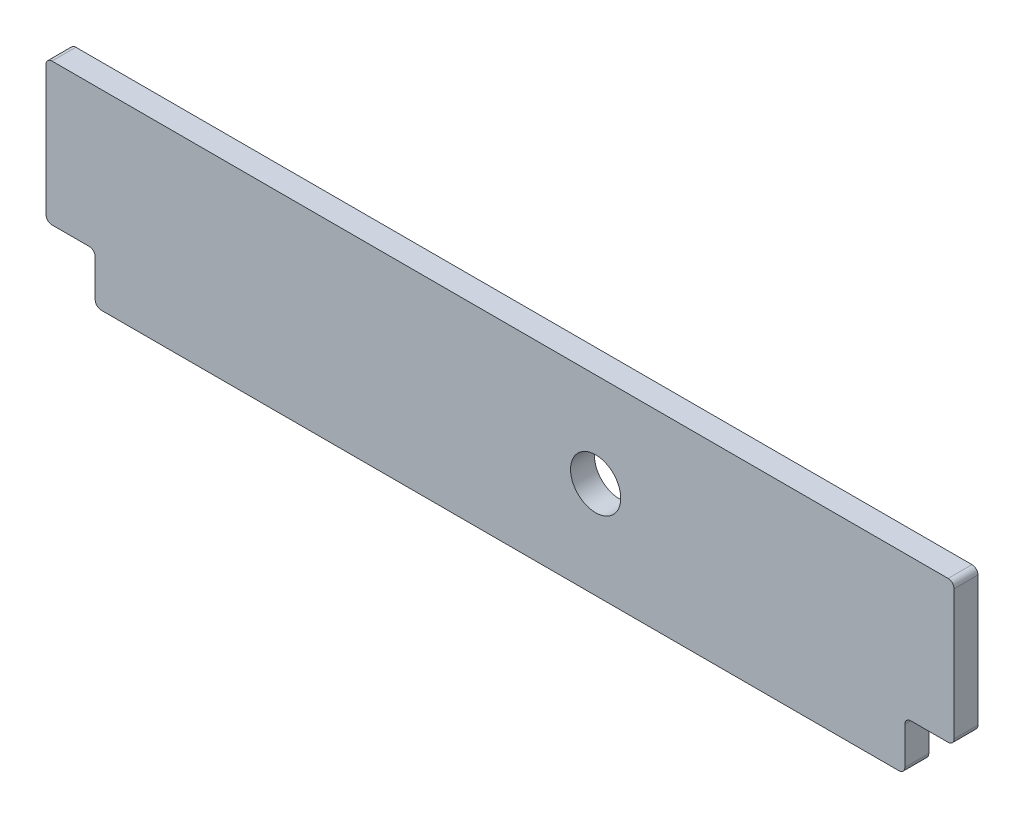
ISO-10303-21;
HEADER;
FILE_DESCRIPTION(('STEP AP214'),'2;1');
FILE_NAME('part.step','',(''),(''),'','','');
FILE_SCHEMA(('AUTOMOTIVE_DESIGN { 1 0 10303 214 1 1 1 1 }'));
ENDSEC;
DATA;
#1=APPLICATION_CONTEXT('core data for automotive mechanical design processes');
#2=APPLICATION_PROTOCOL_DEFINITION('international standard','automotive_design',2000,#1);
#3=PRODUCT_CONTEXT('',#1,'mechanical');
#4=PRODUCT('Part','Part','',(#3));
#5=PRODUCT_RELATED_PRODUCT_CATEGORY('part','',(#4));
#6=PRODUCT_DEFINITION_FORMATION('','',#4);
#7=PRODUCT_DEFINITION_CONTEXT('part definition',#1,'design');
#8=PRODUCT_DEFINITION('design','',#6,#7);
#9=PRODUCT_DEFINITION_SHAPE('','',#8);
#10=(LENGTH_UNIT() NAMED_UNIT(*) SI_UNIT(.MILLI.,.METRE.));
#11=(NAMED_UNIT(*) PLANE_ANGLE_UNIT() SI_UNIT($,.RADIAN.));
#12=(NAMED_UNIT(*) SI_UNIT($,.STERADIAN.) SOLID_ANGLE_UNIT());
#13=UNCERTAINTY_MEASURE_WITH_UNIT(LENGTH_MEASURE(1.E-05),#10,'distance_accuracy_value','');
#14=(GEOMETRIC_REPRESENTATION_CONTEXT(3) GLOBAL_UNCERTAINTY_ASSIGNED_CONTEXT((#13)) GLOBAL_UNIT_ASSIGNED_CONTEXT((#10,
#11,#12)) REPRESENTATION_CONTEXT('',''));
#15=CARTESIAN_POINT('',(0.,0.,0.));
#16=DIRECTION('',(0.,0.,1.));
#17=DIRECTION('',(1.,0.,0.));
#18=AXIS2_PLACEMENT_3D('',#15,#16,#17);
#19=CARTESIAN_POINT('',(215.138,0.,6.35));
#20=DIRECTION('',(-1.,0.,0.));
#21=DIRECTION('',(0.,-1.,0.));
#22=AXIS2_PLACEMENT_3D('',#19,#20,#21);
#23=PLANE('',#22);
#24=DIRECTION('',(0.,1.,0.));
#25=VECTOR('',#24,1.);
#26=CARTESIAN_POINT('',(215.138,2.35089725464378E-13,6.35));
#27=LINE('',#26,#25);
#28=CARTESIAN_POINT('',(215.138,3.17500000000005,6.35));
#29=VERTEX_POINT('',#28);
#30=CARTESIAN_POINT('',(215.138,22.9869999999999,6.35));
#31=VERTEX_POINT('',#30);
#32=EDGE_CURVE('E238',#29,#31,#27,.T.);
#33=ORIENTED_EDGE('',*,*,#32,.F.);
#34=DIRECTION('',(0.,0.,-1.));
#35=VECTOR('',#34,1.);
#36=CARTESIAN_POINT('',(215.138,3.17500000000005,6.35));
#37=LINE('',#36,#35);
#38=CARTESIAN_POINT('',(215.138,3.17500000000005,-6.35));
#39=VERTEX_POINT('',#38);
#40=EDGE_CURVE('E295',#29,#39,#37,.T.);
#41=ORIENTED_EDGE('',*,*,#40,.T.);
#42=DIRECTION('',(0.,1.,0.));
#43=VECTOR('',#42,1.);
#44=CARTESIAN_POINT('',(215.138,2.35089725464378E-13,-6.35));
#45=LINE('',#44,#43);
#46=CARTESIAN_POINT('',(215.138,22.9869999999999,-6.35));
#47=VERTEX_POINT('',#46);
#48=EDGE_CURVE('E234',#39,#47,#45,.T.);
#49=ORIENTED_EDGE('',*,*,#48,.T.);
#50=DIRECTION('',(0.,0.,-1.));
#51=VECTOR('',#50,1.);
#52=CARTESIAN_POINT('',(215.138,22.9869999999999,6.35));
#53=LINE('',#52,#51);
#54=EDGE_CURVE('E292',#47,#31,#53,.F.);
#55=ORIENTED_EDGE('',*,*,#54,.T.);
#56=EDGE_LOOP('',(#33,#41,#49,#55));
#57=FACE_BOUND('',#56,.T.);
#58=ADVANCED_FACE('F46',(#57),#23,.F.);
#59=CARTESIAN_POINT('',(215.9,26.1619999999999,6.35));
#60=DIRECTION('',(0.,1.,0.));
#61=DIRECTION('',(-1.,0.,0.));
#62=AXIS2_PLACEMENT_3D('',#59,#60,#61);
#63=PLANE('',#62);
#64=DIRECTION('',(1.,0.,0.));
#65=VECTOR('',#64,1.);
#66=CARTESIAN_POINT('',(0.,26.162,6.35));
#67=LINE('',#66,#65);
#68=CARTESIAN_POINT('',(218.313,26.1619999999999,6.35));
#69=VERTEX_POINT('',#68);
#70=CARTESIAN_POINT('',(238.125,26.1619999999999,6.35));
#71=VERTEX_POINT('',#70);
#72=EDGE_CURVE('E220',#69,#71,#67,.T.);
#73=ORIENTED_EDGE('',*,*,#72,.F.);
#74=DIRECTION('',(0.,0.,-1.));
#75=VECTOR('',#74,1.);
#76=CARTESIAN_POINT('',(218.313,26.1619999999999,-6.35));
#77=LINE('',#76,#75);
#78=CARTESIAN_POINT('',(218.313,26.1619999999999,-6.35));
#79=VERTEX_POINT('',#78);
#80=EDGE_CURVE('E308',#69,#79,#77,.T.);
#81=ORIENTED_EDGE('',*,*,#80,.T.);
#82=DIRECTION('',(1.,0.,0.));
#83=VECTOR('',#82,1.);
#84=CARTESIAN_POINT('',(0.,26.162,-6.35));
#85=LINE('',#84,#83);
#86=CARTESIAN_POINT('',(238.125,26.1619999999999,-6.35));
#87=VERTEX_POINT('',#86);
#88=EDGE_CURVE('E200',#79,#87,#85,.T.);
#89=ORIENTED_EDGE('',*,*,#88,.T.);
#90=DIRECTION('',(0.,0.,-1.));
#91=VECTOR('',#90,1.);
#92=CARTESIAN_POINT('',(238.125,26.1619999999999,6.35));
#93=LINE('',#92,#91);
#94=EDGE_CURVE('E305',#87,#71,#93,.F.);
#95=ORIENTED_EDGE('',*,*,#94,.T.);
#96=EDGE_LOOP('',(#73,#81,#89,#95));
#97=FACE_BOUND('',#96,.T.);
#98=ADVANCED_FACE('F357',(#97),#63,.F.);
#99=CARTESIAN_POINT('',(241.3,101.6,6.35));
#100=DIRECTION('',(-1.,0.,0.));
#101=DIRECTION('',(0.,-1.,0.));
#102=AXIS2_PLACEMENT_3D('',#99,#100,#101);
#103=PLANE('',#102);
#104=DIRECTION('',(0.,1.,0.));
#105=VECTOR('',#104,1.);
#106=CARTESIAN_POINT('',(241.3,101.6,-6.35));
#107=LINE('',#106,#105);
#108=CARTESIAN_POINT('',(241.3,29.3369999999999,-6.35));
#109=VERTEX_POINT('',#108);
#110=CARTESIAN_POINT('',(241.3,98.4249999999999,-6.35));
#111=VERTEX_POINT('',#110);
#112=EDGE_CURVE('E193',#109,#111,#107,.T.);
#113=ORIENTED_EDGE('',*,*,#112,.T.);
#114=DIRECTION('',(0.,0.,-1.));
#115=VECTOR('',#114,1.);
#116=CARTESIAN_POINT('',(241.3,98.4249999999999,6.35));
#117=LINE('',#116,#115);
#118=CARTESIAN_POINT('',(241.3,98.4249999999999,6.35));
#119=VERTEX_POINT('',#118);
#120=EDGE_CURVE('E168',#111,#119,#117,.F.);
#121=ORIENTED_EDGE('',*,*,#120,.T.);
#122=DIRECTION('',(0.,1.,0.));
#123=VECTOR('',#122,1.);
#124=CARTESIAN_POINT('',(241.3,101.6,6.35));
#125=LINE('',#124,#123);
#126=CARTESIAN_POINT('',(241.3,29.3369999999999,6.35));
#127=VERTEX_POINT('',#126);
#128=EDGE_CURVE('E216',#127,#119,#125,.T.);
#129=ORIENTED_EDGE('',*,*,#128,.F.);
#130=DIRECTION('',(0.,0.,-1.));
#131=VECTOR('',#130,1.);
#132=CARTESIAN_POINT('',(241.3,29.3369999999999,6.35));
#133=LINE('',#132,#131);
#134=EDGE_CURVE('E174',#127,#109,#133,.T.);
#135=ORIENTED_EDGE('',*,*,#134,.T.);
#136=EDGE_LOOP('',(#113,#121,#129,#135));
#137=FACE_BOUND('',#136,.T.);
#138=ADVANCED_FACE('F350',(#137),#103,.F.);
#139=CARTESIAN_POINT('',(-241.3,101.6,6.35));
#140=DIRECTION('',(0.,-1.,0.));
#141=DIRECTION('',(1.,0.,0.));
#142=AXIS2_PLACEMENT_3D('',#139,#140,#141);
#143=PLANE('',#142);
#144=DIRECTION('',(-1.,0.,0.));
#145=VECTOR('',#144,1.);
#146=CARTESIAN_POINT('',(-241.3,101.6,6.35));
#147=LINE('',#146,#145);
#148=CARTESIAN_POINT('',(238.125,101.6,6.35));
#149=VERTEX_POINT('',#148);
#150=CARTESIAN_POINT('',(-238.125,101.6,6.35));
#151=VERTEX_POINT('',#150);
#152=EDGE_CURVE('E184',#149,#151,#147,.T.);
#153=ORIENTED_EDGE('',*,*,#152,.F.);
#154=DIRECTION('',(0.,0.,-1.));
#155=VECTOR('',#154,1.);
#156=CARTESIAN_POINT('',(238.125,101.6,6.35));
#157=LINE('',#156,#155);
#158=CARTESIAN_POINT('',(238.125,101.6,-6.35));
#159=VERTEX_POINT('',#158);
#160=EDGE_CURVE('E167',#149,#159,#157,.T.);
#161=ORIENTED_EDGE('',*,*,#160,.T.);
#162=DIRECTION('',(-1.,0.,0.));
#163=VECTOR('',#162,1.);
#164=CARTESIAN_POINT('',(-241.3,101.6,-6.35));
#165=LINE('',#164,#163);
#166=CARTESIAN_POINT('',(-238.125,101.6,-6.35));
#167=VERTEX_POINT('',#166);
#168=EDGE_CURVE('E181',#159,#167,#165,.T.);
#169=ORIENTED_EDGE('',*,*,#168,.T.);
#170=DIRECTION('',(0.,0.,-1.));
#171=VECTOR('',#170,1.);
#172=CARTESIAN_POINT('',(-238.125,101.6,6.35));
#173=LINE('',#172,#171);
#174=EDGE_CURVE('E187',#167,#151,#173,.F.);
#175=ORIENTED_EDGE('',*,*,#174,.T.);
#176=EDGE_LOOP('',(#153,#161,#169,#175));
#177=FACE_BOUND('',#176,.T.);
#178=ADVANCED_FACE('F180',(#177),#143,.F.);
#179=CARTESIAN_POINT('',(-241.3,101.6,6.35));
#180=DIRECTION('',(1.,0.,0.));
#181=DIRECTION('',(0.,0.,-1.));
#182=AXIS2_PLACEMENT_3D('',#179,#180,#181);
#183=PLANE('',#182);
#184=DIRECTION('',(0.,-1.,0.));
#185=VECTOR('',#184,1.);
#186=CARTESIAN_POINT('',(-241.3,101.6,6.35));
#187=LINE('',#186,#185);
#188=CARTESIAN_POINT('',(-241.3,98.4250000000001,6.35));
#189=VERTEX_POINT('',#188);
#190=CARTESIAN_POINT('',(-241.3,29.3370000000001,6.35));
#191=VERTEX_POINT('',#190);
#192=EDGE_CURVE('E209',#189,#191,#187,.T.);
#193=ORIENTED_EDGE('',*,*,#192,.F.);
#194=DIRECTION('',(0.,0.,-1.));
#195=VECTOR('',#194,1.);
#196=CARTESIAN_POINT('',(-241.3,98.4250000000001,6.35));
#197=LINE('',#196,#195);
#198=CARTESIAN_POINT('',(-241.3,98.4250000000001,-6.35));
#199=VERTEX_POINT('',#198);
#200=EDGE_CURVE('E288',#189,#199,#197,.T.);
#201=ORIENTED_EDGE('',*,*,#200,.T.);
#202=DIRECTION('',(0.,-1.,0.));
#203=VECTOR('',#202,1.);
#204=CARTESIAN_POINT('',(-241.3,101.6,-6.35));
#205=LINE('',#204,#203);
#206=CARTESIAN_POINT('',(-241.3,29.3370000000001,-6.35));
#207=VERTEX_POINT('',#206);
#208=EDGE_CURVE('E192',#199,#207,#205,.T.);
#209=ORIENTED_EDGE('',*,*,#208,.T.);
#210=DIRECTION('',(0.,0.,-1.));
#211=VECTOR('',#210,1.);
#212=CARTESIAN_POINT('',(-241.3,29.337,6.35));
#213=LINE('',#212,#211);
#214=EDGE_CURVE('E285',#207,#191,#213,.F.);
#215=ORIENTED_EDGE('',*,*,#214,.T.);
#216=EDGE_LOOP('',(#193,#201,#209,#215));
#217=FACE_BOUND('',#216,.T.);
#218=ADVANCED_FACE('F396',(#217),#183,.F.);
#219=CARTESIAN_POINT('',(-215.9,26.162,6.35));
#220=DIRECTION('',(0.,1.,0.));
#221=DIRECTION('',(0.,0.,1.));
#222=AXIS2_PLACEMENT_3D('',#219,#220,#221);
#223=PLANE('',#222);
#224=DIRECTION('',(1.,0.,0.));
#225=VECTOR('',#224,1.);
#226=CARTESIAN_POINT('',(0.,26.162,6.35));
#227=LINE('',#226,#225);
#228=CARTESIAN_POINT('',(-238.125,26.162,6.35));
#229=VERTEX_POINT('',#228);
#230=CARTESIAN_POINT('',(-218.313,26.162,6.35));
#231=VERTEX_POINT('',#230);
#232=EDGE_CURVE('E213',#229,#231,#227,.T.);
#233=ORIENTED_EDGE('',*,*,#232,.F.);
#234=DIRECTION('',(0.,0.,-1.));
#235=VECTOR('',#234,1.);
#236=CARTESIAN_POINT('',(-238.125,26.162,6.35));
#237=LINE('',#236,#235);
#238=CARTESIAN_POINT('',(-238.125,26.162,-6.35));
#239=VERTEX_POINT('',#238);
#240=EDGE_CURVE('E315',#229,#239,#237,.T.);
#241=ORIENTED_EDGE('',*,*,#240,.T.);
#242=DIRECTION('',(1.,0.,0.));
#243=VECTOR('',#242,1.);
#244=CARTESIAN_POINT('',(0.,26.162,-6.35));
#245=LINE('',#244,#243);
#246=CARTESIAN_POINT('',(-218.313,26.162,-6.35));
#247=VERTEX_POINT('',#246);
#248=EDGE_CURVE('E198',#239,#247,#245,.T.);
#249=ORIENTED_EDGE('',*,*,#248,.T.);
#250=DIRECTION('',(0.,0.,-1.));
#251=VECTOR('',#250,1.);
#252=CARTESIAN_POINT('',(-218.313,26.162,6.35));
#253=LINE('',#252,#251);
#254=EDGE_CURVE('E312',#247,#231,#253,.F.);
#255=ORIENTED_EDGE('',*,*,#254,.T.);
#256=EDGE_LOOP('',(#233,#241,#249,#255));
#257=FACE_BOUND('',#256,.T.);
#258=ADVANCED_FACE('F388',(#257),#223,.F.);
#259=CARTESIAN_POINT('',(-215.138,25.4,6.35));
#260=DIRECTION('',(1.,0.,0.));
#261=DIRECTION('',(0.,0.,-1.));
#262=AXIS2_PLACEMENT_3D('',#259,#260,#261);
#263=PLANE('',#262);
#264=DIRECTION('',(0.,-1.,0.));
#265=VECTOR('',#264,1.);
#266=CARTESIAN_POINT('',(-215.138,0.,-6.35));
#267=LINE('',#266,#265);
#268=CARTESIAN_POINT('',(-215.138,22.987,-6.35));
#269=VERTEX_POINT('',#268);
#270=CARTESIAN_POINT('',(-215.138,3.17500000000004,-6.35));
#271=VERTEX_POINT('',#270);
#272=EDGE_CURVE('E224',#269,#271,#267,.T.);
#273=ORIENTED_EDGE('',*,*,#272,.T.);
#274=DIRECTION('',(0.,0.,-1.));
#275=VECTOR('',#274,1.);
#276=CARTESIAN_POINT('',(-215.138,3.17500000000004,6.35));
#277=LINE('',#276,#275);
#278=CARTESIAN_POINT('',(-215.138,3.17500000000004,6.35));
#279=VERTEX_POINT('',#278);
#280=EDGE_CURVE('E323',#271,#279,#277,.F.);
#281=ORIENTED_EDGE('',*,*,#280,.T.);
#282=DIRECTION('',(0.,-1.,0.));
#283=VECTOR('',#282,1.);
#284=CARTESIAN_POINT('',(-215.138,0.,6.35));
#285=LINE('',#284,#283);
#286=CARTESIAN_POINT('',(-215.138,22.987,6.35));
#287=VERTEX_POINT('',#286);
#288=EDGE_CURVE('E208',#287,#279,#285,.T.);
#289=ORIENTED_EDGE('',*,*,#288,.F.);
#290=DIRECTION('',(0.,0.,-1.));
#291=VECTOR('',#290,1.);
#292=CARTESIAN_POINT('',(-215.138,22.987,-6.35));
#293=LINE('',#292,#291);
#294=EDGE_CURVE('E319',#287,#269,#293,.T.);
#295=ORIENTED_EDGE('',*,*,#294,.T.);
#296=EDGE_LOOP('',(#273,#281,#289,#295));
#297=FACE_BOUND('',#296,.T.);
#298=ADVANCED_FACE('F378',(#297),#263,.F.);
#299=CARTESIAN_POINT('',(-215.9,0.,6.35));
#300=DIRECTION('',(0.,1.,0.));
#301=DIRECTION('',(0.,0.,1.));
#302=AXIS2_PLACEMENT_3D('',#299,#300,#301);
#303=PLANE('',#302);
#304=DIRECTION('',(1.,0.,0.));
#305=VECTOR('',#304,1.);
#306=CARTESIAN_POINT('',(-215.9,0.,-6.35));
#307=LINE('',#306,#305);
#308=CARTESIAN_POINT('',(-211.963,0.,-6.35));
#309=VERTEX_POINT('',#308);
#310=CARTESIAN_POINT('',(211.963,0.,-6.35));
#311=VERTEX_POINT('',#310);
#312=EDGE_CURVE('E233',#309,#311,#307,.T.);
#313=ORIENTED_EDGE('',*,*,#312,.T.);
#314=DIRECTION('',(0.,0.,-1.));
#315=VECTOR('',#314,1.);
#316=CARTESIAN_POINT('',(211.963,0.,6.35));
#317=LINE('',#316,#315);
#318=CARTESIAN_POINT('',(211.963,0.,6.35));
#319=VERTEX_POINT('',#318);
#320=EDGE_CURVE('E64',#311,#319,#317,.F.);
#321=ORIENTED_EDGE('',*,*,#320,.T.);
#322=DIRECTION('',(1.,0.,0.));
#323=VECTOR('',#322,1.);
#324=CARTESIAN_POINT('',(-215.9,0.,6.35));
#325=LINE('',#324,#323);
#326=CARTESIAN_POINT('',(-211.963,0.,6.35));
#327=VERTEX_POINT('',#326);
#328=EDGE_CURVE('E204',#327,#319,#325,.T.);
#329=ORIENTED_EDGE('',*,*,#328,.F.);
#330=DIRECTION('',(0.,0.,-1.));
#331=VECTOR('',#330,1.);
#332=CARTESIAN_POINT('',(-211.963,0.,6.35));
#333=LINE('',#332,#331);
#334=EDGE_CURVE('E299',#327,#309,#333,.T.);
#335=ORIENTED_EDGE('',*,*,#334,.T.);
#336=EDGE_LOOP('',(#313,#321,#329,#335));
#337=FACE_BOUND('',#336,.T.);
#338=ADVANCED_FACE('F344',(#337),#303,.F.);
#339=CARTESIAN_POINT('',(0.,0.,6.35));
#340=DIRECTION('',(0.,0.,-1.));
#341=DIRECTION('',(-1.,0.,0.));
#342=AXIS2_PLACEMENT_3D('',#339,#340,#341);
#343=PLANE('',#342);
#344=CARTESIAN_POINT('',(50.8000000000006,51.5000000000016,6.34999999999999));
#345=DIRECTION('',(0.,0.,-1.));
#346=DIRECTION('',(-1.,0.,0.));
#347=AXIS2_PLACEMENT_3D('',#344,#345,#346);
#348=CIRCLE('',#347,13.3350000000001);
#349=CARTESIAN_POINT('',(37.4650000000005,51.5000000000016,6.34999999999999));
#350=VERTEX_POINT('',#349);
#351=EDGE_CURVE('E50',#350,#350,#348,.F.);
#352=ORIENTED_EDGE('',*,*,#351,.F.);
#353=EDGE_LOOP('',(#352));
#354=FACE_BOUND('',#353,.T.);
#355=ORIENTED_EDGE('',*,*,#128,.T.);
#356=CARTESIAN_POINT('',(238.125,98.4249999999999,6.35));
#357=DIRECTION('',(0.,0.,-1.));
#358=DIRECTION('',(-1.,0.,0.));
#359=AXIS2_PLACEMENT_3D('',#356,#357,#358);
#360=CIRCLE('',#359,3.175);
#361=EDGE_CURVE('E282',#119,#149,#360,.F.);
#362=ORIENTED_EDGE('',*,*,#361,.T.);
#363=ORIENTED_EDGE('',*,*,#152,.T.);
#364=CARTESIAN_POINT('',(-238.125,98.4250000000001,6.35));
#365=DIRECTION('',(0.,0.,-1.));
#366=DIRECTION('',(-1.,0.,0.));
#367=AXIS2_PLACEMENT_3D('',#364,#365,#366);
#368=CIRCLE('',#367,3.175);
#369=EDGE_CURVE('E279',#151,#189,#368,.F.);
#370=ORIENTED_EDGE('',*,*,#369,.T.);
#371=ORIENTED_EDGE('',*,*,#192,.T.);
#372=CARTESIAN_POINT('',(-238.125,29.337,6.35));
#373=DIRECTION('',(0.,0.,-1.));
#374=DIRECTION('',(-1.,0.,0.));
#375=AXIS2_PLACEMENT_3D('',#372,#373,#374);
#376=CIRCLE('',#375,3.175);
#377=EDGE_CURVE('E270',#191,#229,#376,.F.);
#378=ORIENTED_EDGE('',*,*,#377,.T.);
#379=ORIENTED_EDGE('',*,*,#232,.T.);
#380=CARTESIAN_POINT('',(-218.313,22.987,6.35));
#381=DIRECTION('',(0.,0.,-1.));
#382=DIRECTION('',(-1.,0.,0.));
#383=AXIS2_PLACEMENT_3D('',#380,#381,#382);
#384=CIRCLE('',#383,3.175);
#385=EDGE_CURVE('E12',#231,#287,#384,.T.);
#386=ORIENTED_EDGE('',*,*,#385,.T.);
#387=ORIENTED_EDGE('',*,*,#288,.T.);
#388=CARTESIAN_POINT('',(-211.963,3.17500000000004,6.35));
#389=DIRECTION('',(0.,0.,-1.));
#390=DIRECTION('',(-1.,0.,0.));
#391=AXIS2_PLACEMENT_3D('',#388,#389,#390);
#392=CIRCLE('',#391,3.175);
#393=EDGE_CURVE('E71',#279,#327,#392,.F.);
#394=ORIENTED_EDGE('',*,*,#393,.T.);
#395=ORIENTED_EDGE('',*,*,#328,.T.);
#396=CARTESIAN_POINT('',(211.963,3.17500000000004,6.35));
#397=DIRECTION('',(0.,0.,-1.));
#398=DIRECTION('',(-1.,0.,0.));
#399=AXIS2_PLACEMENT_3D('',#396,#397,#398);
#400=CIRCLE('',#399,3.175);
#401=EDGE_CURVE('E276',#319,#29,#400,.F.);
#402=ORIENTED_EDGE('',*,*,#401,.T.);
#403=ORIENTED_EDGE('',*,*,#32,.T.);
#404=CARTESIAN_POINT('',(218.313,22.9869999999999,6.35));
#405=DIRECTION('',(0.,0.,-1.));
#406=DIRECTION('',(-1.,0.,0.));
#407=AXIS2_PLACEMENT_3D('',#404,#405,#406);
#408=CIRCLE('',#407,3.175);
#409=EDGE_CURVE('E329',#31,#69,#408,.T.);
#410=ORIENTED_EDGE('',*,*,#409,.T.);
#411=ORIENTED_EDGE('',*,*,#72,.T.);
#412=CARTESIAN_POINT('',(238.125,29.3369999999999,6.35));
#413=DIRECTION('',(0.,0.,-1.));
#414=DIRECTION('',(-1.,0.,0.));
#415=AXIS2_PLACEMENT_3D('',#412,#413,#414);
#416=CIRCLE('',#415,3.175);
#417=EDGE_CURVE('E273',#71,#127,#416,.F.);
#418=ORIENTED_EDGE('',*,*,#417,.T.);
#419=EDGE_LOOP('',(#355,#362,#363,#370,#371,#378,#379,#386,#387,#394,#395,#402,#403,#410,#411,#418));
#420=FACE_BOUND('',#419,.T.);
#421=ADVANCED_FACE('F342',(#354,#420),#343,.F.);
#422=CARTESIAN_POINT('',(0.,0.,-6.35));
#423=DIRECTION('',(0.,0.,-1.));
#424=DIRECTION('',(-1.,0.,0.));
#425=AXIS2_PLACEMENT_3D('',#422,#423,#424);
#426=PLANE('',#425);
#427=CARTESIAN_POINT('',(50.8000000000006,51.5000000000016,-6.34999999999999));
#428=DIRECTION('',(0.,0.,-1.));
#429=DIRECTION('',(-1.,0.,0.));
#430=AXIS2_PLACEMENT_3D('',#427,#428,#429);
#431=CIRCLE('',#430,13.3350000000001);
#432=CARTESIAN_POINT('',(37.4650000000005,51.5000000000016,-6.34999999999999));
#433=VERTEX_POINT('',#432);
#434=EDGE_CURVE('E207',#433,#433,#431,.F.);
#435=ORIENTED_EDGE('',*,*,#434,.T.);
#436=EDGE_LOOP('',(#435));
#437=FACE_BOUND('',#436,.T.);
#438=ORIENTED_EDGE('',*,*,#168,.F.);
#439=CARTESIAN_POINT('',(238.125,98.4249999999999,-6.35));
#440=DIRECTION('',(0.,0.,-1.));
#441=DIRECTION('',(-1.,0.,0.));
#442=AXIS2_PLACEMENT_3D('',#439,#440,#441);
#443=CIRCLE('',#442,3.175);
#444=EDGE_CURVE('E163',#159,#111,#443,.T.);
#445=ORIENTED_EDGE('',*,*,#444,.T.);
#446=ORIENTED_EDGE('',*,*,#112,.F.);
#447=CARTESIAN_POINT('',(238.125,29.3369999999999,-6.35));
#448=DIRECTION('',(0.,0.,-1.));
#449=DIRECTION('',(-1.,0.,0.));
#450=AXIS2_PLACEMENT_3D('',#447,#448,#449);
#451=CIRCLE('',#450,3.175);
#452=EDGE_CURVE('E255',#109,#87,#451,.T.);
#453=ORIENTED_EDGE('',*,*,#452,.T.);
#454=ORIENTED_EDGE('',*,*,#88,.F.);
#455=CARTESIAN_POINT('',(218.313,22.9869999999999,-6.35));
#456=DIRECTION('',(0.,0.,-1.));
#457=DIRECTION('',(-1.,0.,0.));
#458=AXIS2_PLACEMENT_3D('',#455,#456,#457);
#459=CIRCLE('',#458,3.175);
#460=EDGE_CURVE('E326',#79,#47,#459,.F.);
#461=ORIENTED_EDGE('',*,*,#460,.T.);
#462=ORIENTED_EDGE('',*,*,#48,.F.);
#463=CARTESIAN_POINT('',(211.963,3.17500000000004,-6.35));
#464=DIRECTION('',(0.,0.,-1.));
#465=DIRECTION('',(-1.,0.,0.));
#466=AXIS2_PLACEMENT_3D('',#463,#464,#465);
#467=CIRCLE('',#466,3.175);
#468=EDGE_CURVE('E258',#39,#311,#467,.T.);
#469=ORIENTED_EDGE('',*,*,#468,.T.);
#470=ORIENTED_EDGE('',*,*,#312,.F.);
#471=CARTESIAN_POINT('',(-211.963,3.17500000000004,-6.35));
#472=DIRECTION('',(0.,0.,-1.));
#473=DIRECTION('',(-1.,0.,0.));
#474=AXIS2_PLACEMENT_3D('',#471,#472,#473);
#475=CIRCLE('',#474,3.175);
#476=EDGE_CURVE('E186',#309,#271,#475,.T.);
#477=ORIENTED_EDGE('',*,*,#476,.T.);
#478=ORIENTED_EDGE('',*,*,#272,.F.);
#479=CARTESIAN_POINT('',(-218.313,22.987,-6.35));
#480=DIRECTION('',(0.,0.,-1.));
#481=DIRECTION('',(-1.,0.,0.));
#482=AXIS2_PLACEMENT_3D('',#479,#480,#481);
#483=CIRCLE('',#482,3.175);
#484=EDGE_CURVE('E56',#269,#247,#483,.F.);
#485=ORIENTED_EDGE('',*,*,#484,.T.);
#486=ORIENTED_EDGE('',*,*,#248,.F.);
#487=CARTESIAN_POINT('',(-238.125,29.337,-6.35));
#488=DIRECTION('',(0.,0.,-1.));
#489=DIRECTION('',(-1.,0.,0.));
#490=AXIS2_PLACEMENT_3D('',#487,#488,#489);
#491=CIRCLE('',#490,3.175);
#492=EDGE_CURVE('E252',#239,#207,#491,.T.);
#493=ORIENTED_EDGE('',*,*,#492,.T.);
#494=ORIENTED_EDGE('',*,*,#208,.F.);
#495=CARTESIAN_POINT('',(-238.125,98.4250000000001,-6.35));
#496=DIRECTION('',(0.,0.,-1.));
#497=DIRECTION('',(-1.,0.,0.));
#498=AXIS2_PLACEMENT_3D('',#495,#496,#497);
#499=CIRCLE('',#498,3.175);
#500=EDGE_CURVE('E175',#199,#167,#499,.T.);
#501=ORIENTED_EDGE('',*,*,#500,.T.);
#502=EDGE_LOOP('',(#438,#445,#446,#453,#454,#461,#462,#469,#470,#477,#478,#485,#486,#493,#494,#501));
#503=FACE_BOUND('',#502,.T.);
#504=ADVANCED_FACE('F189',(#437,#503),#426,.T.);
#505=CARTESIAN_POINT('',(50.8000000000006,51.5000000000017,-101.056542434233));
#506=DIRECTION('',(0.,0.,1.));
#507=DIRECTION('',(0.,-1.,0.));
#508=AXIS2_PLACEMENT_3D('',#505,#506,#507);
#509=CYLINDRICAL_SURFACE('',#508,13.3350000000001);
#510=ORIENTED_EDGE('',*,*,#434,.F.);
#511=EDGE_LOOP('',(#510));
#512=FACE_BOUND('',#511,.T.);
#513=ORIENTED_EDGE('',*,*,#351,.T.);
#514=EDGE_LOOP('',(#513));
#515=FACE_BOUND('',#514,.T.);
#516=ADVANCED_FACE('F48',(#512,#515),#509,.F.);
#517=CARTESIAN_POINT('',(238.125,98.4249999999999,6.35));
#518=DIRECTION('',(0.,0.,-1.));
#519=DIRECTION('',(-1.,0.,0.));
#520=AXIS2_PLACEMENT_3D('',#517,#518,#519);
#521=CYLINDRICAL_SURFACE('',#520,3.175);
#522=ORIENTED_EDGE('',*,*,#361,.F.);
#523=ORIENTED_EDGE('',*,*,#120,.F.);
#524=ORIENTED_EDGE('',*,*,#444,.F.);
#525=ORIENTED_EDGE('',*,*,#160,.F.);
#526=EDGE_LOOP('',(#522,#523,#524,#525));
#527=FACE_BOUND('',#526,.T.);
#528=ADVANCED_FACE('F166',(#527),#521,.T.);
#529=CARTESIAN_POINT('',(-238.125,98.4250000000001,6.35));
#530=DIRECTION('',(0.,0.,-1.));
#531=DIRECTION('',(-1.,0.,0.));
#532=AXIS2_PLACEMENT_3D('',#529,#530,#531);
#533=CYLINDRICAL_SURFACE('',#532,3.175);
#534=ORIENTED_EDGE('',*,*,#369,.F.);
#535=ORIENTED_EDGE('',*,*,#174,.F.);
#536=ORIENTED_EDGE('',*,*,#500,.F.);
#537=ORIENTED_EDGE('',*,*,#200,.F.);
#538=EDGE_LOOP('',(#534,#535,#536,#537));
#539=FACE_BOUND('',#538,.T.);
#540=ADVANCED_FACE('F400',(#539),#533,.T.);
#541=CARTESIAN_POINT('',(211.963,3.17500000000004,6.35));
#542=DIRECTION('',(0.,0.,-1.));
#543=DIRECTION('',(-1.,0.,0.));
#544=AXIS2_PLACEMENT_3D('',#541,#542,#543);
#545=CYLINDRICAL_SURFACE('',#544,3.175);
#546=ORIENTED_EDGE('',*,*,#401,.F.);
#547=ORIENTED_EDGE('',*,*,#320,.F.);
#548=ORIENTED_EDGE('',*,*,#468,.F.);
#549=ORIENTED_EDGE('',*,*,#40,.F.);
#550=EDGE_LOOP('',(#546,#547,#548,#549));
#551=FACE_BOUND('',#550,.T.);
#552=ADVANCED_FACE('F369',(#551),#545,.T.);
#553=CARTESIAN_POINT('',(218.313,22.9869999999999,6.35));
#554=DIRECTION('',(0.,0.,1.));
#555=DIRECTION('',(1.,0.,0.));
#556=AXIS2_PLACEMENT_3D('',#553,#554,#555);
#557=CYLINDRICAL_SURFACE('',#556,3.175);
#558=ORIENTED_EDGE('',*,*,#409,.F.);
#559=ORIENTED_EDGE('',*,*,#54,.F.);
#560=ORIENTED_EDGE('',*,*,#460,.F.);
#561=ORIENTED_EDGE('',*,*,#80,.F.);
#562=EDGE_LOOP('',(#558,#559,#560,#561));
#563=FACE_BOUND('',#562,.T.);
#564=ADVANCED_FACE('F361',(#563),#557,.F.);
#565=CARTESIAN_POINT('',(238.125,29.3369999999999,6.35));
#566=DIRECTION('',(0.,0.,-1.));
#567=DIRECTION('',(-1.,0.,0.));
#568=AXIS2_PLACEMENT_3D('',#565,#566,#567);
#569=CYLINDRICAL_SURFACE('',#568,3.175);
#570=ORIENTED_EDGE('',*,*,#417,.F.);
#571=ORIENTED_EDGE('',*,*,#94,.F.);
#572=ORIENTED_EDGE('',*,*,#452,.F.);
#573=ORIENTED_EDGE('',*,*,#134,.F.);
#574=EDGE_LOOP('',(#570,#571,#572,#573));
#575=FACE_BOUND('',#574,.T.);
#576=ADVANCED_FACE('F352',(#575),#569,.T.);
#577=CARTESIAN_POINT('',(-238.125,29.337,6.35));
#578=DIRECTION('',(0.,0.,-1.));
#579=DIRECTION('',(-1.,0.,0.));
#580=AXIS2_PLACEMENT_3D('',#577,#578,#579);
#581=CYLINDRICAL_SURFACE('',#580,3.175);
#582=ORIENTED_EDGE('',*,*,#377,.F.);
#583=ORIENTED_EDGE('',*,*,#214,.F.);
#584=ORIENTED_EDGE('',*,*,#492,.F.);
#585=ORIENTED_EDGE('',*,*,#240,.F.);
#586=EDGE_LOOP('',(#582,#583,#584,#585));
#587=FACE_BOUND('',#586,.T.);
#588=ADVANCED_FACE('F392',(#587),#581,.T.);
#589=CARTESIAN_POINT('',(-211.963,3.17500000000004,6.35));
#590=DIRECTION('',(0.,0.,-1.));
#591=DIRECTION('',(-1.,0.,0.));
#592=AXIS2_PLACEMENT_3D('',#589,#590,#591);
#593=CYLINDRICAL_SURFACE('',#592,3.175);
#594=ORIENTED_EDGE('',*,*,#393,.F.);
#595=ORIENTED_EDGE('',*,*,#280,.F.);
#596=ORIENTED_EDGE('',*,*,#476,.F.);
#597=ORIENTED_EDGE('',*,*,#334,.F.);
#598=EDGE_LOOP('',(#594,#595,#596,#597));
#599=FACE_BOUND('',#598,.T.);
#600=ADVANCED_FACE('F374',(#599),#593,.T.);
#601=CARTESIAN_POINT('',(-218.313,22.987,6.35));
#602=DIRECTION('',(0.,0.,1.));
#603=DIRECTION('',(1.,0.,0.));
#604=AXIS2_PLACEMENT_3D('',#601,#602,#603);
#605=CYLINDRICAL_SURFACE('',#604,3.175);
#606=ORIENTED_EDGE('',*,*,#385,.F.);
#607=ORIENTED_EDGE('',*,*,#254,.F.);
#608=ORIENTED_EDGE('',*,*,#484,.F.);
#609=ORIENTED_EDGE('',*,*,#294,.F.);
#610=EDGE_LOOP('',(#606,#607,#608,#609));
#611=FACE_BOUND('',#610,.T.);
#612=ADVANCED_FACE('F383',(#611),#605,.F.);
#613=CLOSED_SHELL('',(#58,#98,#138,#178,#218,#258,#298,#338,#421,#504,#516,#528,#540,#552,#564,
#576,#588,#600,#612));
#614=MANIFOLD_SOLID_BREP('B2',#613);
#615=ADVANCED_BREP_SHAPE_REPRESENTATION('',(#18,#614),#14);
#616=SHAPE_DEFINITION_REPRESENTATION(#9,#615);
ENDSEC;
END-ISO-10303-21;
